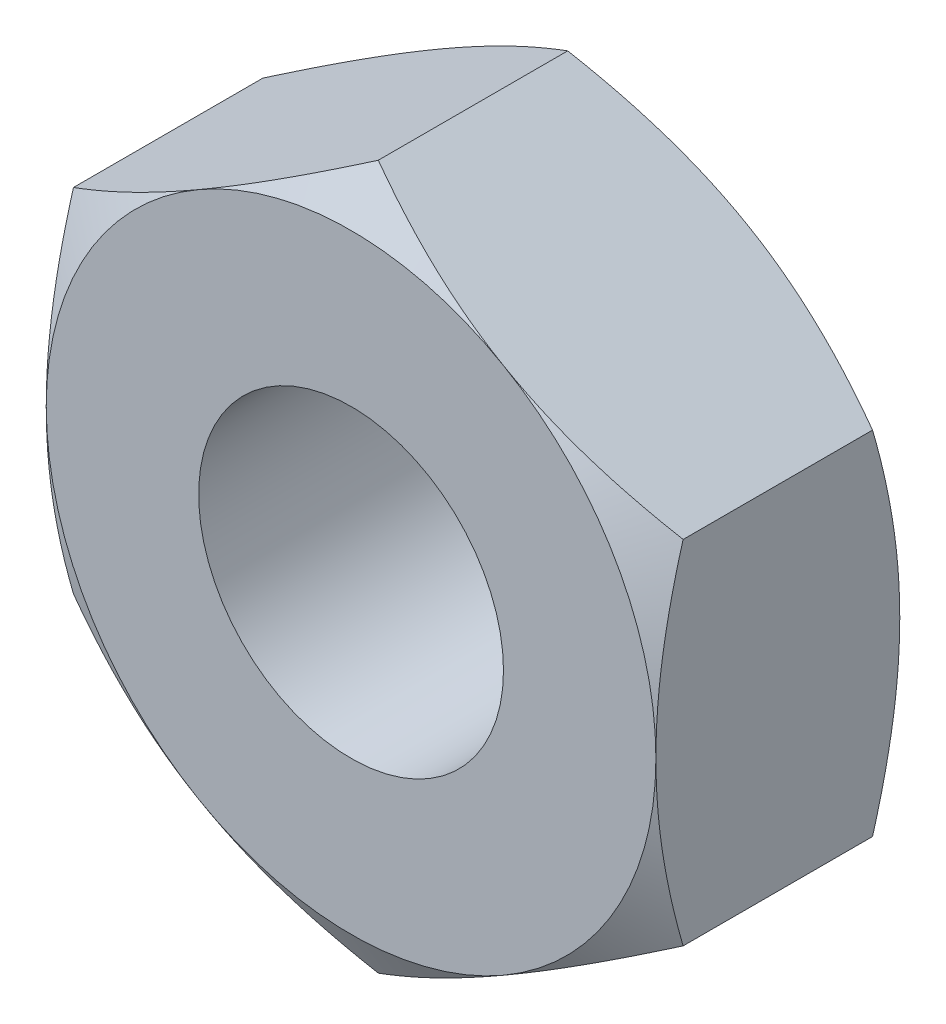
ISO-10303-21;
HEADER;
FILE_DESCRIPTION(('STEP AP214'),'2;1');
FILE_NAME('part.step','',(''),(''),'','','');
FILE_SCHEMA(('AUTOMOTIVE_DESIGN { 1 0 10303 214 1 1 1 1 }'));
ENDSEC;
DATA;
#1=APPLICATION_CONTEXT('core data for automotive mechanical design processes');
#2=APPLICATION_PROTOCOL_DEFINITION('international standard','automotive_design',2000,#1);
#3=PRODUCT_CONTEXT('',#1,'mechanical');
#4=PRODUCT('Part','Part','',(#3));
#5=PRODUCT_RELATED_PRODUCT_CATEGORY('part','',(#4));
#6=PRODUCT_DEFINITION_FORMATION('','',#4);
#7=PRODUCT_DEFINITION_CONTEXT('part definition',#1,'design');
#8=PRODUCT_DEFINITION('design','',#6,#7);
#9=PRODUCT_DEFINITION_SHAPE('','',#8);
#10=(LENGTH_UNIT() NAMED_UNIT(*) SI_UNIT(.MILLI.,.METRE.));
#11=(NAMED_UNIT(*) PLANE_ANGLE_UNIT() SI_UNIT($,.RADIAN.));
#12=(NAMED_UNIT(*) SI_UNIT($,.STERADIAN.) SOLID_ANGLE_UNIT());
#13=UNCERTAINTY_MEASURE_WITH_UNIT(LENGTH_MEASURE(1.E-05),#10,'distance_accuracy_value','');
#14=(GEOMETRIC_REPRESENTATION_CONTEXT(3) GLOBAL_UNCERTAINTY_ASSIGNED_CONTEXT((#13)) GLOBAL_UNIT_ASSIGNED_CONTEXT((#10,
#11,#12)) REPRESENTATION_CONTEXT('',''));
#15=CARTESIAN_POINT('',(0.,0.,0.));
#16=DIRECTION('',(0.,0.,1.));
#17=DIRECTION('',(1.,0.,0.));
#18=AXIS2_PLACEMENT_3D('',#15,#16,#17);
#19=CARTESIAN_POINT('',(0.,0.,-0.800000000000002));
#20=DIRECTION('',(0.,0.,1.));
#21=DIRECTION('',(1.,0.,0.));
#22=AXIS2_PLACEMENT_3D('',#19,#20,#21);
#23=PLANE('',#22);
#24=CARTESIAN_POINT('',(0.,0.,-0.800000000000002));
#25=DIRECTION('',(0.,0.,1.));
#26=DIRECTION('',(1.,0.,0.));
#27=AXIS2_PLACEMENT_3D('',#24,#25,#26);
#28=CIRCLE('',#27,1.);
#29=CARTESIAN_POINT('',(1.,0.,-0.800000000000002));
#30=VERTEX_POINT('',#29);
#31=EDGE_CURVE('E250',#30,#30,#28,.T.);
#32=ORIENTED_EDGE('',*,*,#31,.T.);
#33=EDGE_LOOP('',(#32));
#34=FACE_BOUND('',#33,.T.);
#35=CARTESIAN_POINT('',(0.,0.,-0.800000000000002));
#36=DIRECTION('',(0.,0.,1.));
#37=DIRECTION('',(1.,0.,0.));
#38=AXIS2_PLACEMENT_3D('',#35,#36,#37);
#39=CIRCLE('',#38,2.00000000000001);
#40=CARTESIAN_POINT('',(2.00000000000001,0.,-0.800000000000002));
#41=VERTEX_POINT('',#40);
#42=CARTESIAN_POINT('',(1.,1.73205080756888,-0.800000000000002));
#43=VERTEX_POINT('',#42);
#44=EDGE_CURVE('E138',#41,#43,#39,.T.);
#45=ORIENTED_EDGE('',*,*,#44,.F.);
#46=CARTESIAN_POINT('',(0.,0.,-0.800000000000002));
#47=DIRECTION('',(0.,0.,1.));
#48=DIRECTION('',(1.,0.,0.));
#49=AXIS2_PLACEMENT_3D('',#46,#47,#48);
#50=CIRCLE('',#49,2.00000000000001);
#51=CARTESIAN_POINT('',(1.,-1.73205080756888,-0.800000000000002));
#52=VERTEX_POINT('',#51);
#53=EDGE_CURVE('E12',#41,#52,#50,.F.);
#54=ORIENTED_EDGE('',*,*,#53,.T.);
#55=CARTESIAN_POINT('',(-1.,-1.73205080756888,-0.800000000000002));
#56=VERTEX_POINT('',#55);
#57=EDGE_CURVE('E46',#52,#56,#50,.F.);
#58=ORIENTED_EDGE('',*,*,#57,.T.);
#59=CARTESIAN_POINT('',(-2.00000000000001,0.,-0.800000000000002));
#60=VERTEX_POINT('',#59);
#61=EDGE_CURVE('E427',#56,#60,#50,.F.);
#62=ORIENTED_EDGE('',*,*,#61,.T.);
#63=CARTESIAN_POINT('',(-0.999999999999999,1.73205080756888,-0.800000000000002));
#64=VERTEX_POINT('',#63);
#65=EDGE_CURVE('E146',#60,#64,#50,.F.);
#66=ORIENTED_EDGE('',*,*,#65,.T.);
#67=EDGE_CURVE('E47',#64,#43,#50,.F.);
#68=ORIENTED_EDGE('',*,*,#67,.T.);
#69=EDGE_LOOP('',(#45,#54,#58,#62,#66,#68));
#70=FACE_BOUND('',#69,.T.);
#71=ADVANCED_FACE('F37',(#34,#70),#23,.F.);
#72=CARTESIAN_POINT('',(0.,0.,0.800000000000002));
#73=DIRECTION('',(0.,0.,1.));
#74=DIRECTION('',(1.,0.,0.));
#75=AXIS2_PLACEMENT_3D('',#72,#73,#74);
#76=PLANE('',#75);
#77=CARTESIAN_POINT('',(0.,0.,0.800000000000002));
#78=DIRECTION('',(0.,0.,1.));
#79=DIRECTION('',(1.,0.,0.));
#80=AXIS2_PLACEMENT_3D('',#77,#78,#79);
#81=CIRCLE('',#80,1.);
#82=CARTESIAN_POINT('',(1.,0.,0.800000000000002));
#83=VERTEX_POINT('',#82);
#84=EDGE_CURVE('E253',#83,#83,#81,.T.);
#85=ORIENTED_EDGE('',*,*,#84,.F.);
#86=EDGE_LOOP('',(#85));
#87=FACE_BOUND('',#86,.T.);
#88=CARTESIAN_POINT('',(0.,0.,0.800000000000002));
#89=DIRECTION('',(0.,0.,1.));
#90=DIRECTION('',(1.,0.,0.));
#91=AXIS2_PLACEMENT_3D('',#88,#89,#90);
#92=CIRCLE('',#91,2.00000000000001);
#93=CARTESIAN_POINT('',(0.999999999999995,-1.73205080756887,0.800000000000002));
#94=VERTEX_POINT('',#93);
#95=CARTESIAN_POINT('',(1.99999999999999,0.,0.800000000000002));
#96=VERTEX_POINT('',#95);
#97=EDGE_CURVE('E152',#94,#96,#92,.T.);
#98=ORIENTED_EDGE('',*,*,#97,.T.);
#99=CARTESIAN_POINT('',(1.,1.73205080756888,0.800000000000002));
#100=VERTEX_POINT('',#99);
#101=EDGE_CURVE('E156',#96,#100,#92,.T.);
#102=ORIENTED_EDGE('',*,*,#101,.T.);
#103=CARTESIAN_POINT('',(-0.999999999999999,1.73205080756888,0.800000000000002));
#104=VERTEX_POINT('',#103);
#105=EDGE_CURVE('E301',#100,#104,#92,.T.);
#106=ORIENTED_EDGE('',*,*,#105,.T.);
#107=CARTESIAN_POINT('',(-2.,0.,0.800000000000002));
#108=VERTEX_POINT('',#107);
#109=EDGE_CURVE('E305',#104,#108,#92,.T.);
#110=ORIENTED_EDGE('',*,*,#109,.T.);
#111=CARTESIAN_POINT('',(-0.999999999999998,-1.73205080756887,0.800000000000002));
#112=VERTEX_POINT('',#111);
#113=EDGE_CURVE('E307',#108,#112,#92,.T.);
#114=ORIENTED_EDGE('',*,*,#113,.T.);
#115=EDGE_CURVE('E154',#112,#94,#92,.T.);
#116=ORIENTED_EDGE('',*,*,#115,.T.);
#117=EDGE_LOOP('',(#98,#102,#106,#110,#114,#116));
#118=FACE_BOUND('',#117,.T.);
#119=ADVANCED_FACE('F282',(#87,#118),#76,.T.);
#120=CARTESIAN_POINT('',(1.99999999999999,1.15470053837926,0.800000000000002));
#121=DIRECTION('',(-0.5,-0.866025403784439,0.));
#122=DIRECTION('',(0.866025403784439,-0.5,0.));
#123=AXIS2_PLACEMENT_3D('',#120,#121,#122);
#124=PLANE('',#123);
#125=DIRECTION('',(0.,0.,-1.));
#126=VECTOR('',#125,1.);
#127=CARTESIAN_POINT('',(1.99999999999999,1.15470053837926,0.800000000000002));
#128=LINE('',#127,#126);
#129=CARTESIAN_POINT('',(1.99999999999999,1.15470053837926,0.621367205045927));
#130=VERTEX_POINT('',#129);
#131=CARTESIAN_POINT('',(1.99999999999999,1.15470053837926,-0.621367205045927));
#132=VERTEX_POINT('',#131);
#133=EDGE_CURVE('E151',#130,#132,#128,.T.);
#134=ORIENTED_EDGE('',*,*,#133,.T.);
#135=CARTESIAN_POINT('',(2.00019999999999,1.15458506832542,-0.62130053337951));
#136=CARTESIAN_POINT('',(1.91230873709993,1.20532911262019,-0.650610463899329));
#137=CARTESIAN_POINT('',(1.8236588055264,1.25651117447781,-0.67726714801954));
#138=CARTESIAN_POINT('',(1.64482375300219,1.3597616401932,-0.723797508979285));
#139=CARTESIAN_POINT('',(1.55463545349495,1.41183187919146,-0.743654723617227));
#140=CARTESIAN_POINT('',(1.37537661423668,1.51532701829184,-0.774566535976752));
#141=CARTESIAN_POINT('',(1.28633366177369,1.56673599086579,-0.785826848401473));
#142=CARTESIAN_POINT('',(1.10782860221495,1.66979593505374,-0.799271337405362));
#143=CARTESIAN_POINT('',(1.01836714429603,1.72144653186532,-0.801466645046535));
#144=CARTESIAN_POINT('',(0.851191646451194,1.81796535054795,-0.796909010669354));
#145=CARTESIAN_POINT('',(0.773452629734209,1.86284799277604,-0.791275125312988));
#146=CARTESIAN_POINT('',(0.618481085463861,1.95232085557725,-0.773416104739174));
#147=CARTESIAN_POINT('',(0.541249094258797,1.99691076648955,-0.761184863976563));
#148=CARTESIAN_POINT('',(0.385957813517796,2.08656822922817,-0.730606563132393));
#149=CARTESIAN_POINT('',(0.307918186892618,2.13162442866767,-0.712129832934287));
#150=CARTESIAN_POINT('',(0.153003134307865,2.221064675979,-0.670194481787148));
#151=CARTESIAN_POINT('',(0.0761257223768801,2.26544987045196,-0.64674571950769));
#152=CARTESIAN_POINT('',(-0.000199999999999334,2.30951654681234,-0.621300533379507));
#153=B_SPLINE_CURVE_WITH_KNOTS('',3,(#135,#136,#137,#138,#139,#140,#141,#142,#143,#144,#145,
#146,#147,#148,#149,#150,#151,#152),.UNSPECIFIED.,.F.,.F.,(4,2,2,2,2,2,2,2,4),(0.,
0.317031824695609,0.634825876346562,0.944753967652634,1.25430138000371,1.52387047293093,
1.79368946861027,2.06949491027633,2.34475850821471),.UNSPECIFIED.);
#154=EDGE_CURVE('E59',#132,#43,#153,.T.);
#155=ORIENTED_EDGE('',*,*,#154,.T.);
#156=CARTESIAN_POINT('',(0.,2.3094010767585,-0.621367205045923));
#157=VERTEX_POINT('',#156);
#158=EDGE_CURVE('E127',#43,#157,#153,.T.);
#159=ORIENTED_EDGE('',*,*,#158,.T.);
#160=DIRECTION('',(0.,0.,-1.));
#161=VECTOR('',#160,1.);
#162=CARTESIAN_POINT('',(0.,2.3094010767585,0.800000000000002));
#163=LINE('',#162,#161);
#164=CARTESIAN_POINT('',(0.,2.3094010767585,0.621367205045923));
#165=VERTEX_POINT('',#164);
#166=EDGE_CURVE('E269',#165,#157,#163,.T.);
#167=ORIENTED_EDGE('',*,*,#166,.F.);
#168=CARTESIAN_POINT('',(2.00019999999999,1.15458506832542,0.62130053337951));
#169=CARTESIAN_POINT('',(1.91230873709993,1.20532911262019,0.650610463899329));
#170=CARTESIAN_POINT('',(1.8236588055264,1.25651117447781,0.67726714801954));
#171=CARTESIAN_POINT('',(1.64482375300219,1.3597616401932,0.723797508979285));
#172=CARTESIAN_POINT('',(1.55463545349495,1.41183187919146,0.743654723617227));
#173=CARTESIAN_POINT('',(1.37537661423668,1.51532701829184,0.774566535976752));
#174=CARTESIAN_POINT('',(1.28633366177369,1.56673599086579,0.785826848401473));
#175=CARTESIAN_POINT('',(1.10782860221495,1.66979593505374,0.799271337405362));
#176=CARTESIAN_POINT('',(1.01836714429603,1.72144653186532,0.801466645046535));
#177=CARTESIAN_POINT('',(0.851191646451194,1.81796535054795,0.796909010669354));
#178=CARTESIAN_POINT('',(0.773452629734209,1.86284799277604,0.791275125312988));
#179=CARTESIAN_POINT('',(0.618481085463861,1.95232085557725,0.773416104739174));
#180=CARTESIAN_POINT('',(0.541249094258797,1.99691076648955,0.761184863976563));
#181=CARTESIAN_POINT('',(0.385957813517796,2.08656822922817,0.730606563132393));
#182=CARTESIAN_POINT('',(0.307918186892618,2.13162442866767,0.712129832934287));
#183=CARTESIAN_POINT('',(0.153003134307865,2.221064675979,0.670194481787148));
#184=CARTESIAN_POINT('',(0.0761257223768801,2.26544987045196,0.64674571950769));
#185=CARTESIAN_POINT('',(-0.000199999999999334,2.30951654681234,0.621300533379507));
#186=B_SPLINE_CURVE_WITH_KNOTS('',3,(#168,#169,#170,#171,#172,#173,#174,#175,#176,#177,#178,
#179,#180,#181,#182,#183,#184,#185),.UNSPECIFIED.,.F.,.F.,(4,2,2,2,2,2,2,2,4),(0.,
0.317031824695609,0.634825876346562,0.944753967652634,1.25430138000371,1.52387047293093,
1.79368946861027,2.06949491027633,2.34475850821471),.UNSPECIFIED.);
#187=EDGE_CURVE('E243',#100,#165,#186,.T.);
#188=ORIENTED_EDGE('',*,*,#187,.F.);
#189=EDGE_CURVE('E249',#130,#100,#186,.T.);
#190=ORIENTED_EDGE('',*,*,#189,.F.);
#191=EDGE_LOOP('',(#134,#155,#159,#167,#188,#190));
#192=FACE_BOUND('',#191,.T.);
#193=ADVANCED_FACE('F39',(#192),#124,.F.);
#194=CARTESIAN_POINT('',(0.,2.3094010767585,0.800000000000002));
#195=DIRECTION('',(0.499999999999998,-0.86602540378444,0.));
#196=DIRECTION('',(0.86602540378444,0.499999999999998,0.));
#197=AXIS2_PLACEMENT_3D('',#194,#195,#196);
#198=PLANE('',#197);
#199=ORIENTED_EDGE('',*,*,#166,.T.);
#200=CARTESIAN_POINT('',(0.000200000000000812,2.30951654681234,-0.621300533379506));
#201=CARTESIAN_POINT('',(-0.0876912629000594,2.25877250251758,-0.650610463899325));
#202=CARTESIAN_POINT('',(-0.176341194473591,2.20759044065996,-0.677267148019537));
#203=CARTESIAN_POINT('',(-0.355176246997802,2.10433997494456,-0.723797508979283));
#204=CARTESIAN_POINT('',(-0.445364546505037,2.05226973594631,-0.743654723617225));
#205=CARTESIAN_POINT('',(-0.624623385763306,1.94877459684593,-0.774566535976751));
#206=CARTESIAN_POINT('',(-0.713666338226305,1.89736562427197,-0.785826848401472));
#207=CARTESIAN_POINT('',(-0.892171397785044,1.79430568008403,-0.799271337405361));
#208=CARTESIAN_POINT('',(-0.981632855703959,1.74265508327245,-0.801466645046535));
#209=CARTESIAN_POINT('',(-1.1488083535488,1.64613626458982,-0.796909010669354));
#210=CARTESIAN_POINT('',(-1.22654737026579,1.60125362236173,-0.791275125312988));
#211=CARTESIAN_POINT('',(-1.38151891453614,1.51178075956051,-0.773416104739174));
#212=CARTESIAN_POINT('',(-1.4587509057412,1.46719084864822,-0.761184863976563));
#213=CARTESIAN_POINT('',(-1.6140421864822,1.3775333859096,-0.730606563132392));
#214=CARTESIAN_POINT('',(-1.69208181310738,1.33247718647009,-0.712129832934286));
#215=CARTESIAN_POINT('',(-1.84699686569214,1.24303693915876,-0.670194481787147));
#216=CARTESIAN_POINT('',(-1.92387427762312,1.1986517446858,-0.646745719507689));
#217=CARTESIAN_POINT('',(-2.0002,1.15458506832542,-0.621300533379505));
#218=B_SPLINE_CURVE_WITH_KNOTS('',3,(#200,#201,#202,#203,#204,#205,#206,#207,#208,#209,#210,
#211,#212,#213,#214,#215,#216,#217),.UNSPECIFIED.,.F.,.F.,(4,2,2,2,2,2,2,2,4),(0.,
0.31703182469561,0.634825876346564,0.944753967652636,1.25430138000371,1.52387047293094,
1.79368946861028,2.06949491027634,2.34475850821473),.UNSPECIFIED.);
#219=EDGE_CURVE('E132',#157,#64,#218,.T.);
#220=ORIENTED_EDGE('',*,*,#219,.T.);
#221=CARTESIAN_POINT('',(-2.,1.15470053837926,-0.621367205045921));
#222=VERTEX_POINT('',#221);
#223=EDGE_CURVE('E163',#64,#222,#218,.T.);
#224=ORIENTED_EDGE('',*,*,#223,.T.);
#225=DIRECTION('',(0.,0.,-1.));
#226=VECTOR('',#225,1.);
#227=CARTESIAN_POINT('',(-2.,1.15470053837926,0.800000000000002));
#228=LINE('',#227,#226);
#229=CARTESIAN_POINT('',(-2.,1.15470053837926,0.621367205045921));
#230=VERTEX_POINT('',#229);
#231=EDGE_CURVE('E266',#230,#222,#228,.T.);
#232=ORIENTED_EDGE('',*,*,#231,.F.);
#233=CARTESIAN_POINT('',(0.000200000000000812,2.30951654681234,0.621300533379506));
#234=CARTESIAN_POINT('',(-0.0876912629000594,2.25877250251758,0.650610463899325));
#235=CARTESIAN_POINT('',(-0.176341194473591,2.20759044065996,0.677267148019537));
#236=CARTESIAN_POINT('',(-0.355176246997802,2.10433997494456,0.723797508979283));
#237=CARTESIAN_POINT('',(-0.445364546505037,2.05226973594631,0.743654723617225));
#238=CARTESIAN_POINT('',(-0.624623385763306,1.94877459684593,0.774566535976751));
#239=CARTESIAN_POINT('',(-0.713666338226305,1.89736562427197,0.785826848401472));
#240=CARTESIAN_POINT('',(-0.892171397785044,1.79430568008403,0.799271337405361));
#241=CARTESIAN_POINT('',(-0.981632855703959,1.74265508327245,0.801466645046535));
#242=CARTESIAN_POINT('',(-1.1488083535488,1.64613626458982,0.796909010669354));
#243=CARTESIAN_POINT('',(-1.22654737026579,1.60125362236173,0.791275125312988));
#244=CARTESIAN_POINT('',(-1.38151891453614,1.51178075956051,0.773416104739174));
#245=CARTESIAN_POINT('',(-1.4587509057412,1.46719084864822,0.761184863976563));
#246=CARTESIAN_POINT('',(-1.6140421864822,1.3775333859096,0.730606563132392));
#247=CARTESIAN_POINT('',(-1.69208181310738,1.33247718647009,0.712129832934286));
#248=CARTESIAN_POINT('',(-1.84699686569214,1.24303693915876,0.670194481787147));
#249=CARTESIAN_POINT('',(-1.92387427762312,1.1986517446858,0.646745719507689));
#250=CARTESIAN_POINT('',(-2.0002,1.15458506832542,0.621300533379505));
#251=B_SPLINE_CURVE_WITH_KNOTS('',3,(#233,#234,#235,#236,#237,#238,#239,#240,#241,#242,#243,
#244,#245,#246,#247,#248,#249,#250),.UNSPECIFIED.,.F.,.F.,(4,2,2,2,2,2,2,2,4),(0.,
0.31703182469561,0.634825876346564,0.944753967652636,1.25430138000371,1.52387047293094,
1.79368946861028,2.06949491027634,2.34475850821473),.UNSPECIFIED.);
#252=EDGE_CURVE('E236',#104,#230,#251,.T.);
#253=ORIENTED_EDGE('',*,*,#252,.F.);
#254=EDGE_CURVE('E242',#165,#104,#251,.T.);
#255=ORIENTED_EDGE('',*,*,#254,.F.);
#256=EDGE_LOOP('',(#199,#220,#224,#232,#253,#255));
#257=FACE_BOUND('',#256,.T.);
#258=ADVANCED_FACE('F216',(#257),#198,.F.);
#259=CARTESIAN_POINT('',(-2.,1.15470053837926,0.800000000000002));
#260=DIRECTION('',(1.,0.,0.));
#261=DIRECTION('',(0.,1.,0.));
#262=AXIS2_PLACEMENT_3D('',#259,#260,#261);
#263=PLANE('',#262);
#264=ORIENTED_EDGE('',*,*,#231,.T.);
#265=CARTESIAN_POINT('',(-2.,-3.14743047654046,0.198306552850407));
#266=CARTESIAN_POINT('',(-2.,-3.05967210244812,0.155553868976941));
#267=CARTESIAN_POINT('',(-2.,-2.97171709984302,0.113198125280131));
#268=CARTESIAN_POINT('',(-2.,-2.79530942001979,0.0295029218519922));
#269=CARTESIAN_POINT('',(-2.,-2.70685667089521,-0.0118363861550447));
#270=CARTESIAN_POINT('',(-2.,-2.52891504543682,-0.0934745468336477));
#271=CARTESIAN_POINT('',(-2.,-2.43942317489822,-0.133766894988972));
#272=CARTESIAN_POINT('',(-2.,-2.25974335517447,-0.212762396383488));
#273=CARTESIAN_POINT('',(-2.,-2.16955543783013,-0.251465621811502));
#274=CARTESIAN_POINT('',(-2.,-1.98527196879577,-0.328141363705169));
#275=CARTESIAN_POINT('',(-2.,-1.89114750628803,-0.366044763197902));
#276=CARTESIAN_POINT('',(-2.,-1.70183294408363,-0.439084605273424));
#277=CARTESIAN_POINT('',(-2.,-1.60664293762428,-0.474221287821171));
#278=CARTESIAN_POINT('',(-2.,-1.41518203816933,-0.540850496108792));
#279=CARTESIAN_POINT('',(-2.,-1.31891348177163,-0.572349670657675));
#280=CARTESIAN_POINT('',(-2.,-1.12499622861148,-0.630719653237138));
#281=CARTESIAN_POINT('',(-2.,-1.02734796207529,-0.657591871040161));
#282=CARTESIAN_POINT('',(-2.,-0.831155178970928,-0.70530614287482));
#283=CARTESIAN_POINT('',(-2.,-0.732618998809856,-0.726181852738169));
#284=CARTESIAN_POINT('',(-2.,-0.534275684214456,-0.76075339142046));
#285=CARTESIAN_POINT('',(-2.,-0.434468688672742,-0.774449998089526));
#286=CARTESIAN_POINT('',(-2.,-0.235400315881099,-0.793390191057686));
#287=CARTESIAN_POINT('',(-2.,-0.136149929105309,-0.798746020812808));
#288=CARTESIAN_POINT('',(-2.,0.0624411832173077,-0.800861920991032));
#289=CARTESIAN_POINT('',(-2.,0.16178191011786,-0.797621860412022));
#290=CARTESIAN_POINT('',(-2.,0.397385015097493,-0.780019496600158));
#291=CARTESIAN_POINT('',(-2.,0.533369746619378,-0.761906918753455));
#292=CARTESIAN_POINT('',(-2.,0.802950751329166,-0.712625767050231));
#293=CARTESIAN_POINT('',(-2.,0.936544747020608,-0.681445369779727));
#294=CARTESIAN_POINT('',(-2.,1.20415328853255,-0.608631407271918));
#295=CARTESIAN_POINT('',(-2.,1.33810419419207,-0.566769802383892));
#296=CARTESIAN_POINT('',(-2.,1.53715171848285,-0.498678676980695));
#297=CARTESIAN_POINT('',(-2.,1.60318282855604,-0.475100500137474));
#298=CARTESIAN_POINT('',(-2.,1.73469382343812,-0.42645414084253));
#299=CARTESIAN_POINT('',(-2.,1.80017372071485,-0.401385992196316));
#300=CARTESIAN_POINT('',(-2.,1.97604049113679,-0.332133085670553));
#301=CARTESIAN_POINT('',(-2.,2.08596811744942,-0.286784871314014));
#302=CARTESIAN_POINT('',(-2.,2.3046938444931,-0.193432023273477));
#303=CARTESIAN_POINT('',(-2.,2.41349182359984,-0.1454271070046));
#304=CARTESIAN_POINT('',(-2.,2.63021356509041,-0.0473911285308202));
#305=CARTESIAN_POINT('',(-2.,2.7381370097335,0.00264063366716507));
#306=CARTESIAN_POINT('',(-2.,2.95325272972541,0.104254973803327));
#307=CARTESIAN_POINT('',(-2.,3.06044498281287,0.155837598701775));
#308=CARTESIAN_POINT('',(-2.,3.38147646251264,0.312545190507859));
#309=CARTESIAN_POINT('',(-2.00000000000001,3.59443363993267,0.419474740091152));
#310=CARTESIAN_POINT('',(-2.00000000000001,4.01873866766052,0.636349674676729));
#311=CARTESIAN_POINT('',(-2.00000000000001,4.2300868435542,0.746294427639898));
#312=CARTESIAN_POINT('',(-2.00000000000001,4.62945943906715,0.956537342735007));
#313=CARTESIAN_POINT('',(-2.00000000000001,4.81759240607136,1.05662966634099));
#314=CARTESIAN_POINT('',(-2.00000000000001,5.19322505857694,1.25802116090653));
#315=CARTESIAN_POINT('',(-2.00000000000001,5.38072470449695,1.35932040556842));
#316=CARTESIAN_POINT('',(-2.00000000000001,5.7546105695392,1.5624739160313));
#317=CARTESIAN_POINT('',(-2.00000000000001,5.94099841514985,1.66432519196928));
#318=CARTESIAN_POINT('',(-2.00000000000001,6.31337850698986,1.86871405091757));
#319=CARTESIAN_POINT('',(-2.00000000000001,6.49937078318764,1.97125157930546));
#320=CARTESIAN_POINT('',(-2.00000000000001,6.68522403643259,2.07403873577321));
#321=B_SPLINE_CURVE_WITH_KNOTS('',3,(#265,#266,#267,#268,#269,#270,#271,#272,#273,#274,#275,
#276,#277,#278,#279,#280,#281,#282,#283,#284,#285,#286,#287,#288,#289,#290,#291,#292,#293,#294,
#295,#296,#297,#298,#299,#300,#301,#302,#303,#304,#305,#306,#307,#308,#309,#310,#311,#312,#313,
#314,#315,#316,#317,#318,#319,#320),.UNSPECIFIED.,.F.,.F.,(4,2,2,2,2,2,2,2,2,2,2,2,2,2,2,2,2,2,
2,2,2,2,2,2,2,2,2,4),(0.,0.292858137509559,0.585759728041967,0.880179690347561,1.17458626325434,
1.47896161268405,1.78331053365848,2.08709403815516,2.39078481942149,2.69273623340005,
2.99465492441653,3.29247440702637,3.59029842845696,4.00100978875948,4.41209355470286,
4.83281993450001,5.04315129430591,5.25347788378898,5.61016899779103,5.96689812507929,
6.32375152082678,6.68061573303352,7.3954562078898,8.11014796809599,8.7494481193876,
9.38878751260475,10.0259883790783,10.6631391166861),.UNSPECIFIED.);
#322=EDGE_CURVE('E210',#222,#60,#321,.F.);
#323=ORIENTED_EDGE('',*,*,#322,.T.);
#324=CARTESIAN_POINT('',(-2.,-1.15470053837924,-0.621367205045926));
#325=VERTEX_POINT('',#324);
#326=EDGE_CURVE('E203',#60,#325,#321,.F.);
#327=ORIENTED_EDGE('',*,*,#326,.T.);
#328=DIRECTION('',(0.,0.,-1.));
#329=VECTOR('',#328,1.);
#330=CARTESIAN_POINT('',(-2.,-1.15470053837924,0.800000000000002));
#331=LINE('',#330,#329);
#332=CARTESIAN_POINT('',(-2.,-1.15470053837924,0.621367205045926));
#333=VERTEX_POINT('',#332);
#334=EDGE_CURVE('E263',#333,#325,#331,.T.);
#335=ORIENTED_EDGE('',*,*,#334,.F.);
#336=CARTESIAN_POINT('',(-2.,-3.14743047654046,-0.198306552850407));
#337=CARTESIAN_POINT('',(-2.,-3.05967210244812,-0.155553868976941));
#338=CARTESIAN_POINT('',(-2.,-2.97171709984302,-0.113198125280131));
#339=CARTESIAN_POINT('',(-2.,-2.79530942001979,-0.0295029218519922));
#340=CARTESIAN_POINT('',(-2.,-2.70685667089521,0.0118363861550447));
#341=CARTESIAN_POINT('',(-2.,-2.52891504543682,0.0934745468336477));
#342=CARTESIAN_POINT('',(-2.,-2.43942317489822,0.133766894988972));
#343=CARTESIAN_POINT('',(-2.,-2.25974335517447,0.212762396383488));
#344=CARTESIAN_POINT('',(-2.,-2.16955543783013,0.251465621811502));
#345=CARTESIAN_POINT('',(-2.,-1.98527196879577,0.328141363705169));
#346=CARTESIAN_POINT('',(-2.,-1.89114750628803,0.366044763197902));
#347=CARTESIAN_POINT('',(-2.,-1.70183294408363,0.439084605273424));
#348=CARTESIAN_POINT('',(-2.,-1.60664293762428,0.474221287821171));
#349=CARTESIAN_POINT('',(-2.,-1.41518203816933,0.540850496108792));
#350=CARTESIAN_POINT('',(-2.,-1.31891348177163,0.572349670657675));
#351=CARTESIAN_POINT('',(-2.,-1.12499622861148,0.630719653237138));
#352=CARTESIAN_POINT('',(-2.,-1.02734796207529,0.657591871040161));
#353=CARTESIAN_POINT('',(-2.,-0.831155178970928,0.70530614287482));
#354=CARTESIAN_POINT('',(-2.,-0.732618998809856,0.726181852738169));
#355=CARTESIAN_POINT('',(-2.,-0.534275684214456,0.76075339142046));
#356=CARTESIAN_POINT('',(-2.,-0.434468688672742,0.774449998089526));
#357=CARTESIAN_POINT('',(-2.,-0.235400315881099,0.793390191057686));
#358=CARTESIAN_POINT('',(-2.,-0.136149929105309,0.798746020812808));
#359=CARTESIAN_POINT('',(-2.,0.0624411832173077,0.800861920991032));
#360=CARTESIAN_POINT('',(-2.,0.16178191011786,0.797621860412022));
#361=CARTESIAN_POINT('',(-2.,0.397385015097493,0.780019496600158));
#362=CARTESIAN_POINT('',(-2.,0.533369746619378,0.761906918753455));
#363=CARTESIAN_POINT('',(-2.,0.802950751329166,0.712625767050231));
#364=CARTESIAN_POINT('',(-2.,0.936544747020608,0.681445369779727));
#365=CARTESIAN_POINT('',(-2.,1.20415328853255,0.608631407271918));
#366=CARTESIAN_POINT('',(-2.,1.33810419419207,0.566769802383892));
#367=CARTESIAN_POINT('',(-2.,1.53715171848285,0.498678676980695));
#368=CARTESIAN_POINT('',(-2.,1.60318282855604,0.475100500137474));
#369=CARTESIAN_POINT('',(-2.,1.73469382343812,0.42645414084253));
#370=CARTESIAN_POINT('',(-2.,1.80017372071485,0.401385992196316));
#371=CARTESIAN_POINT('',(-2.,1.97604049113679,0.332133085670553));
#372=CARTESIAN_POINT('',(-2.,2.08596811744942,0.286784871314014));
#373=CARTESIAN_POINT('',(-2.,2.3046938444931,0.193432023273477));
#374=CARTESIAN_POINT('',(-2.,2.41349182359984,0.1454271070046));
#375=CARTESIAN_POINT('',(-2.,2.63021356509041,0.0473911285308202));
#376=CARTESIAN_POINT('',(-2.,2.7381370097335,-0.00264063366716507));
#377=CARTESIAN_POINT('',(-2.,2.95325272972541,-0.104254973803327));
#378=CARTESIAN_POINT('',(-2.,3.06044498281287,-0.155837598701775));
#379=CARTESIAN_POINT('',(-2.,3.38147646251264,-0.312545190507859));
#380=CARTESIAN_POINT('',(-2.00000000000001,3.59443363993267,-0.419474740091152));
#381=CARTESIAN_POINT('',(-2.00000000000001,4.01873866766052,-0.636349674676729));
#382=CARTESIAN_POINT('',(-2.00000000000001,4.2300868435542,-0.746294427639898));
#383=CARTESIAN_POINT('',(-2.00000000000001,4.62945943906715,-0.956537342735007));
#384=CARTESIAN_POINT('',(-2.00000000000001,4.81759240607136,-1.05662966634099));
#385=CARTESIAN_POINT('',(-2.00000000000001,5.19322505857694,-1.25802116090653));
#386=CARTESIAN_POINT('',(-2.00000000000001,5.38072470449695,-1.35932040556842));
#387=CARTESIAN_POINT('',(-2.00000000000001,5.7546105695392,-1.5624739160313));
#388=CARTESIAN_POINT('',(-2.00000000000001,5.94099841514985,-1.66432519196928));
#389=CARTESIAN_POINT('',(-2.00000000000001,6.31337850698986,-1.86871405091757));
#390=CARTESIAN_POINT('',(-2.00000000000001,6.49937078318764,-1.97125157930546));
#391=CARTESIAN_POINT('',(-2.00000000000001,6.68522403643259,-2.07403873577321));
#392=B_SPLINE_CURVE_WITH_KNOTS('',3,(#336,#337,#338,#339,#340,#341,#342,#343,#344,#345,#346,
#347,#348,#349,#350,#351,#352,#353,#354,#355,#356,#357,#358,#359,#360,#361,#362,#363,#364,#365,
#366,#367,#368,#369,#370,#371,#372,#373,#374,#375,#376,#377,#378,#379,#380,#381,#382,#383,#384,
#385,#386,#387,#388,#389,#390,#391),.UNSPECIFIED.,.F.,.F.,(4,2,2,2,2,2,2,2,2,2,2,2,2,2,2,2,2,2,
2,2,2,2,2,2,2,2,2,4),(0.,0.292858137509559,0.585759728041967,0.880179690347561,1.17458626325434,
1.47896161268405,1.78331053365848,2.08709403815516,2.39078481942149,2.69273623340005,
2.99465492441653,3.29247440702637,3.59029842845696,4.00100978875948,4.41209355470286,
4.83281993450001,5.04315129430591,5.25347788378898,5.61016899779103,5.96689812507929,
6.32375152082678,6.68061573303352,7.3954562078898,8.11014796809599,8.7494481193876,
9.38878751260475,10.0259883790783,10.6631391166861),.UNSPECIFIED.);
#393=EDGE_CURVE('E222',#108,#333,#392,.F.);
#394=ORIENTED_EDGE('',*,*,#393,.F.);
#395=EDGE_CURVE('E229',#230,#108,#392,.F.);
#396=ORIENTED_EDGE('',*,*,#395,.F.);
#397=EDGE_LOOP('',(#264,#323,#327,#335,#394,#396));
#398=FACE_BOUND('',#397,.T.);
#399=ADVANCED_FACE('F212',(#398),#263,.F.);
#400=CARTESIAN_POINT('',(-2.,-1.15470053837924,0.800000000000002));
#401=DIRECTION('',(0.500000000000001,0.866025403784438,0.));
#402=DIRECTION('',(-0.866025403784438,0.500000000000001,0.));
#403=AXIS2_PLACEMENT_3D('',#400,#401,#402);
#404=PLANE('',#403);
#405=ORIENTED_EDGE('',*,*,#334,.T.);
#406=CARTESIAN_POINT('',(-2.0002,-1.1545850683254,-0.621300533379509));
#407=CARTESIAN_POINT('',(-1.91230873709994,-1.20532911262017,-0.650610463899329));
#408=CARTESIAN_POINT('',(-1.82365880552641,-1.25651117447779,-0.677267148019541));
#409=CARTESIAN_POINT('',(-1.6448237530022,-1.35976164019318,-0.723797508979287));
#410=CARTESIAN_POINT('',(-1.55463545349497,-1.41183187919144,-0.743654723617229));
#411=CARTESIAN_POINT('',(-1.3753766142367,-1.51532701829182,-0.774566535976755));
#412=CARTESIAN_POINT('',(-1.2863336617737,-1.56673599086577,-0.785826848401477));
#413=CARTESIAN_POINT('',(-1.10782860221496,-1.66979593505372,-0.799271337405367));
#414=CARTESIAN_POINT('',(-1.01836714429605,-1.7214465318653,-0.801466645046541));
#415=CARTESIAN_POINT('',(-0.851191646451206,-1.81796535054793,-0.79690901066936));
#416=CARTESIAN_POINT('',(-0.773452629734221,-1.86284799277602,-0.791275125312995));
#417=CARTESIAN_POINT('',(-0.618481085463871,-1.95232085557724,-0.773416104739181));
#418=CARTESIAN_POINT('',(-0.541249094258806,-1.99691076648953,-0.76118486397657));
#419=CARTESIAN_POINT('',(-0.385957813517803,-2.08656822922815,-0.7306065631324));
#420=CARTESIAN_POINT('',(-0.307918186892624,-2.13162442866766,-0.712129832934294));
#421=CARTESIAN_POINT('',(-0.153003134307869,-2.22106467597899,-0.670194481787154));
#422=CARTESIAN_POINT('',(-0.0761257223768834,-2.26544987045195,-0.646745719507697));
#423=CARTESIAN_POINT('',(0.000199999999996325,-2.30951654681233,-0.621300533379513));
#424=B_SPLINE_CURVE_WITH_KNOTS('',3,(#406,#407,#408,#409,#410,#411,#412,#413,#414,#415,#416,
#417,#418,#419,#420,#421,#422,#423),.UNSPECIFIED.,.F.,.F.,(4,2,2,2,2,2,2,2,4),(0.,
0.317031824695609,0.634825876346562,0.944753967652634,1.25430138000371,1.52387047293094,
1.79368946861028,2.06949491027634,2.34475850821472),.UNSPECIFIED.);
#425=EDGE_CURVE('E211',#325,#56,#424,.T.);
#426=ORIENTED_EDGE('',*,*,#425,.T.);
#427=CARTESIAN_POINT('',(0.,-2.30940107675849,-0.621367205045929));
#428=VERTEX_POINT('',#427);
#429=EDGE_CURVE('E197',#56,#428,#424,.T.);
#430=ORIENTED_EDGE('',*,*,#429,.T.);
#431=DIRECTION('',(0.,0.,-1.));
#432=VECTOR('',#431,1.);
#433=CARTESIAN_POINT('',(0.,-2.30940107675849,0.800000000000002));
#434=LINE('',#433,#432);
#435=CARTESIAN_POINT('',(0.,-2.30940107675849,0.621367205045929));
#436=VERTEX_POINT('',#435);
#437=EDGE_CURVE('E260',#436,#428,#434,.T.);
#438=ORIENTED_EDGE('',*,*,#437,.F.);
#439=CARTESIAN_POINT('',(-2.0002,-1.1545850683254,0.621300533379509));
#440=CARTESIAN_POINT('',(-1.91230873709994,-1.20532911262017,0.650610463899329));
#441=CARTESIAN_POINT('',(-1.82365880552641,-1.25651117447779,0.677267148019541));
#442=CARTESIAN_POINT('',(-1.6448237530022,-1.35976164019318,0.723797508979287));
#443=CARTESIAN_POINT('',(-1.55463545349497,-1.41183187919144,0.743654723617229));
#444=CARTESIAN_POINT('',(-1.3753766142367,-1.51532701829182,0.774566535976755));
#445=CARTESIAN_POINT('',(-1.2863336617737,-1.56673599086577,0.785826848401477));
#446=CARTESIAN_POINT('',(-1.10782860221496,-1.66979593505372,0.799271337405367));
#447=CARTESIAN_POINT('',(-1.01836714429605,-1.7214465318653,0.801466645046541));
#448=CARTESIAN_POINT('',(-0.851191646451206,-1.81796535054793,0.79690901066936));
#449=CARTESIAN_POINT('',(-0.773452629734221,-1.86284799277602,0.791275125312995));
#450=CARTESIAN_POINT('',(-0.618481085463871,-1.95232085557724,0.773416104739181));
#451=CARTESIAN_POINT('',(-0.541249094258806,-1.99691076648953,0.76118486397657));
#452=CARTESIAN_POINT('',(-0.385957813517803,-2.08656822922815,0.7306065631324));
#453=CARTESIAN_POINT('',(-0.307918186892624,-2.13162442866766,0.712129832934294));
#454=CARTESIAN_POINT('',(-0.153003134307869,-2.22106467597899,0.670194481787154));
#455=CARTESIAN_POINT('',(-0.0761257223768834,-2.26544987045195,0.646745719507697));
#456=CARTESIAN_POINT('',(0.000199999999996325,-2.30951654681233,0.621300533379513));
#457=B_SPLINE_CURVE_WITH_KNOTS('',3,(#439,#440,#441,#442,#443,#444,#445,#446,#447,#448,#449,
#450,#451,#452,#453,#454,#455,#456),.UNSPECIFIED.,.F.,.F.,(4,2,2,2,2,2,2,2,4),(0.,
0.317031824695609,0.634825876346562,0.944753967652634,1.25430138000371,1.52387047293094,
1.79368946861028,2.06949491027634,2.34475850821472),.UNSPECIFIED.);
#458=EDGE_CURVE('E231',#112,#436,#457,.T.);
#459=ORIENTED_EDGE('',*,*,#458,.F.);
#460=EDGE_CURVE('E230',#333,#112,#457,.T.);
#461=ORIENTED_EDGE('',*,*,#460,.F.);
#462=EDGE_LOOP('',(#405,#426,#430,#438,#459,#461));
#463=FACE_BOUND('',#462,.T.);
#464=ADVANCED_FACE('F215',(#463),#404,.F.);
#465=CARTESIAN_POINT('',(0.,-2.30940107675849,0.800000000000002));
#466=DIRECTION('',(-0.5,0.866025403784439,0.));
#467=DIRECTION('',(-0.866025403784438,-0.5,0.));
#468=AXIS2_PLACEMENT_3D('',#465,#466,#467);
#469=PLANE('',#468);
#470=ORIENTED_EDGE('',*,*,#437,.T.);
#471=CARTESIAN_POINT('',(-0.00020000000000397,-2.30951654681233,-0.621300533379513));
#472=CARTESIAN_POINT('',(0.0876912629000558,-2.25877250251757,-0.650610463899332));
#473=CARTESIAN_POINT('',(0.176341194473587,-2.20759044065995,-0.677267148019543));
#474=CARTESIAN_POINT('',(0.355176246997797,-2.10433997494455,-0.723797508979289));
#475=CARTESIAN_POINT('',(0.445364546505031,-2.0522697359463,-0.743654723617231));
#476=CARTESIAN_POINT('',(0.624623385763299,-1.94877459684592,-0.774566535976758));
#477=CARTESIAN_POINT('',(0.713666338226297,-1.89736562427197,-0.785826848401479));
#478=CARTESIAN_POINT('',(0.892171397785035,-1.79430568008402,-0.799271337405368));
#479=CARTESIAN_POINT('',(0.98163285570395,-1.74265508327244,-0.801466645046542));
#480=CARTESIAN_POINT('',(1.14880835354879,-1.64613626458981,-0.796909010669362));
#481=CARTESIAN_POINT('',(1.22654737026577,-1.60125362236172,-0.791275125312996));
#482=CARTESIAN_POINT('',(1.38151891453612,-1.5117807595605,-0.773416104739183));
#483=CARTESIAN_POINT('',(1.45875090574119,-1.46719084864821,-0.761184863976572));
#484=CARTESIAN_POINT('',(1.61404218648219,-1.37753338590959,-0.730606563132401));
#485=CARTESIAN_POINT('',(1.69208181310737,-1.33247718647008,-0.712129832934295));
#486=CARTESIAN_POINT('',(1.84699686569213,-1.24303693915875,-0.670194481787156));
#487=CARTESIAN_POINT('',(1.92387427762311,-1.19865174468579,-0.646745719507698));
#488=CARTESIAN_POINT('',(2.00019999999999,-1.15458506832541,-0.621300533379514));
#489=B_SPLINE_CURVE_WITH_KNOTS('',3,(#471,#472,#473,#474,#475,#476,#477,#478,#479,#480,#481,
#482,#483,#484,#485,#486,#487,#488),.UNSPECIFIED.,.F.,.F.,(4,2,2,2,2,2,2,2,4),(0.,
0.317031824695609,0.634825876346561,0.944753967652632,1.25430138000371,1.52387047293093,
1.79368946861028,2.06949491027633,2.34475850821472),.UNSPECIFIED.);
#490=EDGE_CURVE('E327',#428,#52,#489,.T.);
#491=ORIENTED_EDGE('',*,*,#490,.T.);
#492=CARTESIAN_POINT('',(1.99999999999999,-1.15470053837934,-0.621367205045995));
#493=VERTEX_POINT('',#492);
#494=EDGE_CURVE('E190',#52,#493,#489,.T.);
#495=ORIENTED_EDGE('',*,*,#494,.T.);
#496=DIRECTION('',(0.,0.,-1.));
#497=VECTOR('',#496,1.);
#498=CARTESIAN_POINT('',(1.99999999999999,-1.15470053837925,0.800000000000002));
#499=LINE('',#498,#497);
#500=CARTESIAN_POINT('',(1.99999999999999,-1.15470053837934,0.621367205045995));
#501=VERTEX_POINT('',#500);
#502=EDGE_CURVE('E257',#501,#493,#499,.T.);
#503=ORIENTED_EDGE('',*,*,#502,.F.);
#504=CARTESIAN_POINT('',(-0.00020000000000397,-2.30951654681233,0.621300533379513));
#505=CARTESIAN_POINT('',(0.0876912629000558,-2.25877250251757,0.650610463899332));
#506=CARTESIAN_POINT('',(0.176341194473587,-2.20759044065995,0.677267148019543));
#507=CARTESIAN_POINT('',(0.355176246997797,-2.10433997494455,0.723797508979289));
#508=CARTESIAN_POINT('',(0.445364546505031,-2.0522697359463,0.743654723617231));
#509=CARTESIAN_POINT('',(0.624623385763299,-1.94877459684592,0.774566535976758));
#510=CARTESIAN_POINT('',(0.713666338226297,-1.89736562427197,0.785826848401479));
#511=CARTESIAN_POINT('',(0.892171397785035,-1.79430568008402,0.799271337405368));
#512=CARTESIAN_POINT('',(0.98163285570395,-1.74265508327244,0.801466645046542));
#513=CARTESIAN_POINT('',(1.14880835354879,-1.64613626458981,0.796909010669362));
#514=CARTESIAN_POINT('',(1.22654737026577,-1.60125362236172,0.791275125312996));
#515=CARTESIAN_POINT('',(1.38151891453612,-1.5117807595605,0.773416104739183));
#516=CARTESIAN_POINT('',(1.45875090574119,-1.46719084864821,0.761184863976572));
#517=CARTESIAN_POINT('',(1.61404218648219,-1.37753338590959,0.730606563132401));
#518=CARTESIAN_POINT('',(1.69208181310737,-1.33247718647008,0.712129832934295));
#519=CARTESIAN_POINT('',(1.84699686569213,-1.24303693915875,0.670194481787156));
#520=CARTESIAN_POINT('',(1.92387427762311,-1.19865174468579,0.646745719507698));
#521=CARTESIAN_POINT('',(2.00019999999999,-1.15458506832541,0.621300533379514));
#522=B_SPLINE_CURVE_WITH_KNOTS('',3,(#504,#505,#506,#507,#508,#509,#510,#511,#512,#513,#514,
#515,#516,#517,#518,#519,#520,#521),.UNSPECIFIED.,.F.,.F.,(4,2,2,2,2,2,2,2,4),(0.,
0.317031824695609,0.634825876346561,0.944753967652632,1.25430138000371,1.52387047293093,
1.79368946861028,2.06949491027633,2.34475850821472),.UNSPECIFIED.);
#523=EDGE_CURVE('E289',#94,#501,#522,.T.);
#524=ORIENTED_EDGE('',*,*,#523,.F.);
#525=EDGE_CURVE('E294',#436,#94,#522,.T.);
#526=ORIENTED_EDGE('',*,*,#525,.F.);
#527=EDGE_LOOP('',(#470,#491,#495,#503,#524,#526));
#528=FACE_BOUND('',#527,.T.);
#529=ADVANCED_FACE('F280',(#528),#469,.F.);
#530=CARTESIAN_POINT('',(1.99999999999999,-1.15470053837925,0.800000000000002));
#531=DIRECTION('',(-1.,0.,0.));
#532=DIRECTION('',(0.,-1.,0.));
#533=AXIS2_PLACEMENT_3D('',#530,#531,#532);
#534=PLANE('',#533);
#535=ORIENTED_EDGE('',*,*,#502,.T.);
#536=CARTESIAN_POINT('',(1.99999999999999,-3.14743047830183,0.198306553708704));
#537=CARTESIAN_POINT('',(1.99999999999999,-3.05967210415018,0.155553869799469));
#538=CARTESIAN_POINT('',(1.99999999999999,-2.97171710148573,0.11319812606691));
#539=CARTESIAN_POINT('',(1.99999999999999,-2.79530942154363,0.029502922567445));
#540=CARTESIAN_POINT('',(1.99999999999999,-2.70685667235953,-0.0118363854751685));
#541=CARTESIAN_POINT('',(1.99999999999999,-2.5289150467812,-0.0934745462249423));
#542=CARTESIAN_POINT('',(1.99999999999999,-2.43942317618217,-0.133766894415854));
#543=CARTESIAN_POINT('',(1.99999999999999,-2.25974335633717,-0.212762395880961));
#544=CARTESIAN_POINT('',(1.99999999999999,-2.169555438932,-0.251465621343977));
#545=CARTESIAN_POINT('',(1.99999999999999,-1.98527196977116,-0.328141363308722));
#546=CARTESIAN_POINT('',(1.99999999999999,-1.89114750719772,-0.366044762837449));
#547=CARTESIAN_POINT('',(1.99999999999999,-1.70183294486091,-0.439084604983036));
#548=CARTESIAN_POINT('',(1.99999999999999,-1.60664293833484,-0.474221287564856));
#549=CARTESIAN_POINT('',(1.99999999999999,-1.41518203874523,-0.540850495917403));
#550=CARTESIAN_POINT('',(1.99999999999999,-1.31891348227957,-0.572349670497149));
#551=CARTESIAN_POINT('',(1.99999999999999,-1.12499622898167,-0.630719653133347));
#552=CARTESIAN_POINT('',(1.99999999999999,-1.02734796237569,-0.657591870962249));
#553=CARTESIAN_POINT('',(1.99999999999999,-0.831155179096222,-0.705306142849181));
#554=CARTESIAN_POINT('',(1.99999999999999,-0.732618998829363,-0.726181852736963));
#555=CARTESIAN_POINT('',(1.99999999999999,-0.5342756840198,-0.760753391452211));
#556=CARTESIAN_POINT('',(1.99999999999999,-0.434468688369715,-0.774449998129814));
#557=CARTESIAN_POINT('',(1.99999999999999,-0.235400315363096,-0.793390191095705));
#558=CARTESIAN_POINT('',(1.99999999999999,-0.136149928480724,-0.798746020840382));
#559=CARTESIAN_POINT('',(1.99999999999999,0.0624411840534565,-0.80086192097901));
#560=CARTESIAN_POINT('',(1.99999999999999,0.161781911058993,-0.797621860370844));
#561=CARTESIAN_POINT('',(1.99999999999999,0.397385016198182,-0.780019496477893));
#562=CARTESIAN_POINT('',(1.99999999999999,0.533369747773685,-0.761906918582319));
#563=CARTESIAN_POINT('',(1.99999999999999,0.802950752586599,-0.712625766780174));
#564=CARTESIAN_POINT('',(1.99999999999999,0.936544748327541,-0.68144536945961));
#565=CARTESIAN_POINT('',(1.99999999999999,1.20415328993901,-0.608631406852858));
#566=CARTESIAN_POINT('',(1.99999999999999,1.33810419564847,-0.566769801915919));
#567=CARTESIAN_POINT('',(1.99999999999999,1.5371517200138,-0.498678676441952));
#568=CARTESIAN_POINT('',(1.99999999999999,1.60318283011173,-0.475100499575594));
#569=CARTESIAN_POINT('',(1.99999999999999,1.7346938250433,-0.42645414023519));
#570=CARTESIAN_POINT('',(1.99999999999999,1.80017372234478,-0.401385991566653));
#571=CARTESIAN_POINT('',(1.99999999999999,1.97604049278071,-0.332133085002521));
#572=CARTESIAN_POINT('',(1.99999999999999,2.08596811908332,-0.286784870632344));
#573=CARTESIAN_POINT('',(1.99999999999999,2.30469384610825,-0.193432022568481));
#574=CARTESIAN_POINT('',(1.99999999999999,2.41349182520626,-0.145427106289916));
#575=CARTESIAN_POINT('',(1.99999999999999,2.63021356668033,-0.0473911277996166));
#576=CARTESIAN_POINT('',(1.99999999999999,2.73813701131562,0.00264063440519704));
#577=CARTESIAN_POINT('',(1.99999999999999,2.95325273129279,0.10425497455298));
#578=CARTESIAN_POINT('',(1.99999999999999,3.06044498437328,0.15583759945622));
#579=CARTESIAN_POINT('',(1.99999999999999,3.38147646405228,0.312545191274091));
#580=CARTESIAN_POINT('',(1.99999999999999,3.59443364145944,0.419474740862157));
#581=CARTESIAN_POINT('',(1.99999999999999,4.01873866916326,0.636349675454098));
#582=CARTESIAN_POINT('',(1.99999999999999,4.23008684504578,0.746294428418861));
#583=CARTESIAN_POINT('',(1.99999999999999,4.62945944054765,0.956537343519957));
#584=CARTESIAN_POINT('',(1.99999999999999,4.81759240755182,1.05662966713061));
#585=CARTESIAN_POINT('',(1.99999999999999,5.19322506005774,1.25802116170453));
#586=CARTESIAN_POINT('',(1.99999999999999,5.38072470597815,1.35932040637015));
#587=CARTESIAN_POINT('',(1.99999999999999,5.75461057102308,1.56247391684066));
#588=CARTESIAN_POINT('',(1.99999999999999,5.94099841663601,1.66432519278257));
#589=CARTESIAN_POINT('',(1.99999999999999,6.31337850848086,1.86871405173829));
#590=CARTESIAN_POINT('',(1.99999999999999,6.4993707846812,1.97125158012968));
#591=CARTESIAN_POINT('',(1.99999999999999,6.68522403792878,2.0740387366008));
#592=B_SPLINE_CURVE_WITH_KNOTS('',3,(#536,#537,#538,#539,#540,#541,#542,#543,#544,#545,#546,
#547,#548,#549,#550,#551,#552,#553,#554,#555,#556,#557,#558,#559,#560,#561,#562,#563,#564,#565,
#566,#567,#568,#569,#570,#571,#572,#573,#574,#575,#576,#577,#578,#579,#580,#581,#582,#583,#584,
#585,#586,#587,#588,#589,#590,#591),.UNSPECIFIED.,.F.,.F.,(4,2,2,2,2,2,2,2,2,2,2,2,2,2,2,2,2,2,
2,2,2,2,2,2,2,2,2,4),(0.,0.292858137716497,0.585759728455873,0.88017969097059,1.17458626408648,
1.47896161373933,1.78331053493685,2.08709403965597,2.39078482114456,2.6927362354481,
2.99465492678908,3.29247440971527,3.59029843146235,4.00100979194347,4.41209355806588,
4.83281993805015,5.04315129794933,5.25347788752568,5.61016900151571,5.96689812879181,
6.32375152452677,6.68061573672095,7.39545621154927,8.11014797172797,8.74944812302605,
9.38878751624954,10.0259883827347,10.6631391203543),.UNSPECIFIED.);
#593=EDGE_CURVE('E329',#493,#41,#592,.T.);
#594=ORIENTED_EDGE('',*,*,#593,.T.);
#595=EDGE_CURVE('E140',#41,#132,#592,.T.);
#596=ORIENTED_EDGE('',*,*,#595,.T.);
#597=ORIENTED_EDGE('',*,*,#133,.F.);
#598=CARTESIAN_POINT('',(1.99999999999999,-3.14743047830183,-0.198306553708704));
#599=CARTESIAN_POINT('',(1.99999999999999,-3.05967210415018,-0.155553869799469));
#600=CARTESIAN_POINT('',(1.99999999999999,-2.97171710148573,-0.11319812606691));
#601=CARTESIAN_POINT('',(1.99999999999999,-2.79530942154363,-0.029502922567445));
#602=CARTESIAN_POINT('',(1.99999999999999,-2.70685667235953,0.0118363854751685));
#603=CARTESIAN_POINT('',(1.99999999999999,-2.5289150467812,0.0934745462249423));
#604=CARTESIAN_POINT('',(1.99999999999999,-2.43942317618217,0.133766894415854));
#605=CARTESIAN_POINT('',(1.99999999999999,-2.25974335633717,0.212762395880961));
#606=CARTESIAN_POINT('',(1.99999999999999,-2.169555438932,0.251465621343977));
#607=CARTESIAN_POINT('',(1.99999999999999,-1.98527196977116,0.328141363308722));
#608=CARTESIAN_POINT('',(1.99999999999999,-1.89114750719772,0.366044762837449));
#609=CARTESIAN_POINT('',(1.99999999999999,-1.70183294486091,0.439084604983036));
#610=CARTESIAN_POINT('',(1.99999999999999,-1.60664293833484,0.474221287564856));
#611=CARTESIAN_POINT('',(1.99999999999999,-1.41518203874523,0.540850495917403));
#612=CARTESIAN_POINT('',(1.99999999999999,-1.31891348227957,0.572349670497149));
#613=CARTESIAN_POINT('',(1.99999999999999,-1.12499622898167,0.630719653133347));
#614=CARTESIAN_POINT('',(1.99999999999999,-1.02734796237569,0.657591870962249));
#615=CARTESIAN_POINT('',(1.99999999999999,-0.831155179096222,0.705306142849181));
#616=CARTESIAN_POINT('',(1.99999999999999,-0.732618998829363,0.726181852736963));
#617=CARTESIAN_POINT('',(1.99999999999999,-0.5342756840198,0.760753391452211));
#618=CARTESIAN_POINT('',(1.99999999999999,-0.434468688369715,0.774449998129814));
#619=CARTESIAN_POINT('',(1.99999999999999,-0.235400315363096,0.793390191095705));
#620=CARTESIAN_POINT('',(1.99999999999999,-0.136149928480724,0.798746020840382));
#621=CARTESIAN_POINT('',(1.99999999999999,0.0624411840534565,0.80086192097901));
#622=CARTESIAN_POINT('',(1.99999999999999,0.161781911058993,0.797621860370844));
#623=CARTESIAN_POINT('',(1.99999999999999,0.397385016198182,0.780019496477893));
#624=CARTESIAN_POINT('',(1.99999999999999,0.533369747773685,0.761906918582319));
#625=CARTESIAN_POINT('',(1.99999999999999,0.802950752586599,0.712625766780174));
#626=CARTESIAN_POINT('',(1.99999999999999,0.936544748327541,0.68144536945961));
#627=CARTESIAN_POINT('',(1.99999999999999,1.20415328993901,0.608631406852858));
#628=CARTESIAN_POINT('',(1.99999999999999,1.33810419564847,0.566769801915919));
#629=CARTESIAN_POINT('',(1.99999999999999,1.5371517200138,0.498678676441952));
#630=CARTESIAN_POINT('',(1.99999999999999,1.60318283011173,0.475100499575594));
#631=CARTESIAN_POINT('',(1.99999999999999,1.7346938250433,0.42645414023519));
#632=CARTESIAN_POINT('',(1.99999999999999,1.80017372234478,0.401385991566653));
#633=CARTESIAN_POINT('',(1.99999999999999,1.97604049278071,0.332133085002521));
#634=CARTESIAN_POINT('',(1.99999999999999,2.08596811908332,0.286784870632344));
#635=CARTESIAN_POINT('',(1.99999999999999,2.30469384610825,0.193432022568481));
#636=CARTESIAN_POINT('',(1.99999999999999,2.41349182520626,0.145427106289916));
#637=CARTESIAN_POINT('',(1.99999999999999,2.63021356668033,0.0473911277996166));
#638=CARTESIAN_POINT('',(1.99999999999999,2.73813701131562,-0.00264063440519704));
#639=CARTESIAN_POINT('',(1.99999999999999,2.95325273129279,-0.10425497455298));
#640=CARTESIAN_POINT('',(1.99999999999999,3.06044498437328,-0.15583759945622));
#641=CARTESIAN_POINT('',(1.99999999999999,3.38147646405228,-0.312545191274091));
#642=CARTESIAN_POINT('',(1.99999999999999,3.59443364145944,-0.419474740862157));
#643=CARTESIAN_POINT('',(1.99999999999999,4.01873866916326,-0.636349675454098));
#644=CARTESIAN_POINT('',(1.99999999999999,4.23008684504578,-0.746294428418861));
#645=CARTESIAN_POINT('',(1.99999999999999,4.62945944054765,-0.956537343519957));
#646=CARTESIAN_POINT('',(1.99999999999999,4.81759240755182,-1.05662966713061));
#647=CARTESIAN_POINT('',(1.99999999999999,5.19322506005774,-1.25802116170453));
#648=CARTESIAN_POINT('',(1.99999999999999,5.38072470597815,-1.35932040637015));
#649=CARTESIAN_POINT('',(1.99999999999999,5.75461057102308,-1.56247391684066));
#650=CARTESIAN_POINT('',(1.99999999999999,5.94099841663601,-1.66432519278257));
#651=CARTESIAN_POINT('',(1.99999999999999,6.31337850848086,-1.86871405173829));
#652=CARTESIAN_POINT('',(1.99999999999999,6.4993707846812,-1.97125158012968));
#653=CARTESIAN_POINT('',(1.99999999999999,6.68522403792878,-2.0740387366008));
#654=B_SPLINE_CURVE_WITH_KNOTS('',3,(#598,#599,#600,#601,#602,#603,#604,#605,#606,#607,#608,
#609,#610,#611,#612,#613,#614,#615,#616,#617,#618,#619,#620,#621,#622,#623,#624,#625,#626,#627,
#628,#629,#630,#631,#632,#633,#634,#635,#636,#637,#638,#639,#640,#641,#642,#643,#644,#645,#646,
#647,#648,#649,#650,#651,#652,#653),.UNSPECIFIED.,.F.,.F.,(4,2,2,2,2,2,2,2,2,2,2,2,2,2,2,2,2,2,
2,2,2,2,2,2,2,2,2,4),(0.,0.292858137716497,0.585759728455873,0.88017969097059,1.17458626408648,
1.47896161373933,1.78331053493685,2.08709403965597,2.39078482114456,2.6927362354481,
2.99465492678908,3.29247440971527,3.59029843146235,4.00100979194347,4.41209355806588,
4.83281993805015,5.04315129794933,5.25347788752568,5.61016900151571,5.96689812879181,
6.32375152452677,6.68061573672095,7.39545621154927,8.11014797172797,8.74944812302605,
9.38878751624954,10.0259883827347,10.6631391203543),.UNSPECIFIED.);
#655=EDGE_CURVE('E270',#96,#130,#654,.T.);
#656=ORIENTED_EDGE('',*,*,#655,.F.);
#657=EDGE_CURVE('E147',#501,#96,#654,.T.);
#658=ORIENTED_EDGE('',*,*,#657,.F.);
#659=EDGE_LOOP('',(#535,#594,#596,#597,#656,#658));
#660=FACE_BOUND('',#659,.T.);
#661=ADVANCED_FACE('F275',(#660),#534,.F.);
#662=CARTESIAN_POINT('',(0.,0.,0.800000000000002));
#663=DIRECTION('',(0.,0.,-1.));
#664=DIRECTION('',(-1.,0.,0.));
#665=AXIS2_PLACEMENT_3D('',#662,#663,#664);
#666=CYLINDRICAL_SURFACE('',#665,1.);
#667=ORIENTED_EDGE('',*,*,#84,.T.);
#668=EDGE_LOOP('',(#667));
#669=FACE_BOUND('',#668,.T.);
#670=ORIENTED_EDGE('',*,*,#31,.F.);
#671=EDGE_LOOP('',(#670));
#672=FACE_BOUND('',#671,.T.);
#673=ADVANCED_FACE('F279',(#669,#672),#666,.F.);
#674=CARTESIAN_POINT('',(0.,0.,0.800000000000002));
#675=DIRECTION('',(0.,0.,-1.));
#676=DIRECTION('',(1.,0.,0.));
#677=AXIS2_PLACEMENT_3D('',#674,#675,#676);
#678=CONICAL_SURFACE('',#677,2.00000000000001,1.0471975511966);
#679=ORIENTED_EDGE('',*,*,#189,.T.);
#680=ORIENTED_EDGE('',*,*,#101,.F.);
#681=ORIENTED_EDGE('',*,*,#655,.T.);
#682=EDGE_LOOP('',(#679,#680,#681));
#683=FACE_BOUND('',#682,.T.);
#684=ADVANCED_FACE('F175',(#683),#678,.T.);
#685=ORIENTED_EDGE('',*,*,#523,.T.);
#686=ORIENTED_EDGE('',*,*,#657,.T.);
#687=ORIENTED_EDGE('',*,*,#97,.F.);
#688=EDGE_LOOP('',(#685,#686,#687));
#689=FACE_BOUND('',#688,.T.);
#690=ADVANCED_FACE('F330',(#689),#678,.T.);
#691=ORIENTED_EDGE('',*,*,#458,.T.);
#692=ORIENTED_EDGE('',*,*,#525,.T.);
#693=ORIENTED_EDGE('',*,*,#115,.F.);
#694=EDGE_LOOP('',(#691,#692,#693));
#695=FACE_BOUND('',#694,.T.);
#696=ADVANCED_FACE('F312',(#695),#678,.T.);
#697=ORIENTED_EDGE('',*,*,#393,.T.);
#698=ORIENTED_EDGE('',*,*,#460,.T.);
#699=ORIENTED_EDGE('',*,*,#113,.F.);
#700=EDGE_LOOP('',(#697,#698,#699));
#701=FACE_BOUND('',#700,.T.);
#702=ADVANCED_FACE('F317',(#701),#678,.T.);
#703=ORIENTED_EDGE('',*,*,#252,.T.);
#704=ORIENTED_EDGE('',*,*,#395,.T.);
#705=ORIENTED_EDGE('',*,*,#109,.F.);
#706=EDGE_LOOP('',(#703,#704,#705));
#707=FACE_BOUND('',#706,.T.);
#708=ADVANCED_FACE('F375',(#707),#678,.T.);
#709=ORIENTED_EDGE('',*,*,#187,.T.);
#710=ORIENTED_EDGE('',*,*,#254,.T.);
#711=ORIENTED_EDGE('',*,*,#105,.F.);
#712=EDGE_LOOP('',(#709,#710,#711));
#713=FACE_BOUND('',#712,.T.);
#714=ADVANCED_FACE('F173',(#713),#678,.T.);
#715=CARTESIAN_POINT('',(0.,0.,-0.800000000000002));
#716=DIRECTION('',(0.,0.,1.));
#717=DIRECTION('',(1.,0.,0.));
#718=AXIS2_PLACEMENT_3D('',#715,#716,#717);
#719=CONICAL_SURFACE('',#718,2.00000000000001,1.0471975511966);
#720=ORIENTED_EDGE('',*,*,#595,.F.);
#721=ORIENTED_EDGE('',*,*,#44,.T.);
#722=ORIENTED_EDGE('',*,*,#154,.F.);
#723=EDGE_LOOP('',(#720,#721,#722));
#724=FACE_BOUND('',#723,.T.);
#725=ADVANCED_FACE('F139',(#724),#719,.T.);
#726=ORIENTED_EDGE('',*,*,#67,.F.);
#727=ORIENTED_EDGE('',*,*,#219,.F.);
#728=ORIENTED_EDGE('',*,*,#158,.F.);
#729=EDGE_LOOP('',(#726,#727,#728));
#730=FACE_BOUND('',#729,.T.);
#731=ADVANCED_FACE('F128',(#730),#719,.T.);
#732=ORIENTED_EDGE('',*,*,#65,.F.);
#733=ORIENTED_EDGE('',*,*,#322,.F.);
#734=ORIENTED_EDGE('',*,*,#223,.F.);
#735=EDGE_LOOP('',(#732,#733,#734));
#736=FACE_BOUND('',#735,.T.);
#737=ADVANCED_FACE('F398',(#736),#719,.T.);
#738=ORIENTED_EDGE('',*,*,#61,.F.);
#739=ORIENTED_EDGE('',*,*,#425,.F.);
#740=ORIENTED_EDGE('',*,*,#326,.F.);
#741=EDGE_LOOP('',(#738,#739,#740));
#742=FACE_BOUND('',#741,.T.);
#743=ADVANCED_FACE('F404',(#742),#719,.T.);
#744=ORIENTED_EDGE('',*,*,#57,.F.);
#745=ORIENTED_EDGE('',*,*,#490,.F.);
#746=ORIENTED_EDGE('',*,*,#429,.F.);
#747=EDGE_LOOP('',(#744,#745,#746));
#748=FACE_BOUND('',#747,.T.);
#749=ADVANCED_FACE('F411',(#748),#719,.T.);
#750=ORIENTED_EDGE('',*,*,#53,.F.);
#751=ORIENTED_EDGE('',*,*,#593,.F.);
#752=ORIENTED_EDGE('',*,*,#494,.F.);
#753=EDGE_LOOP('',(#750,#751,#752));
#754=FACE_BOUND('',#753,.T.);
#755=ADVANCED_FACE('F174',(#754),#719,.T.);
#756=CLOSED_SHELL('',(#71,#119,#193,#258,#399,#464,#529,#661,#673,#684,#690,#696,#702,#708,#714,
#725,#731,#737,#743,#749,#755));
#757=MANIFOLD_SOLID_BREP('B2',#756);
#758=ADVANCED_BREP_SHAPE_REPRESENTATION('',(#18,#757),#14);
#759=SHAPE_DEFINITION_REPRESENTATION(#9,#758);
ENDSEC;
END-ISO-10303-21;
